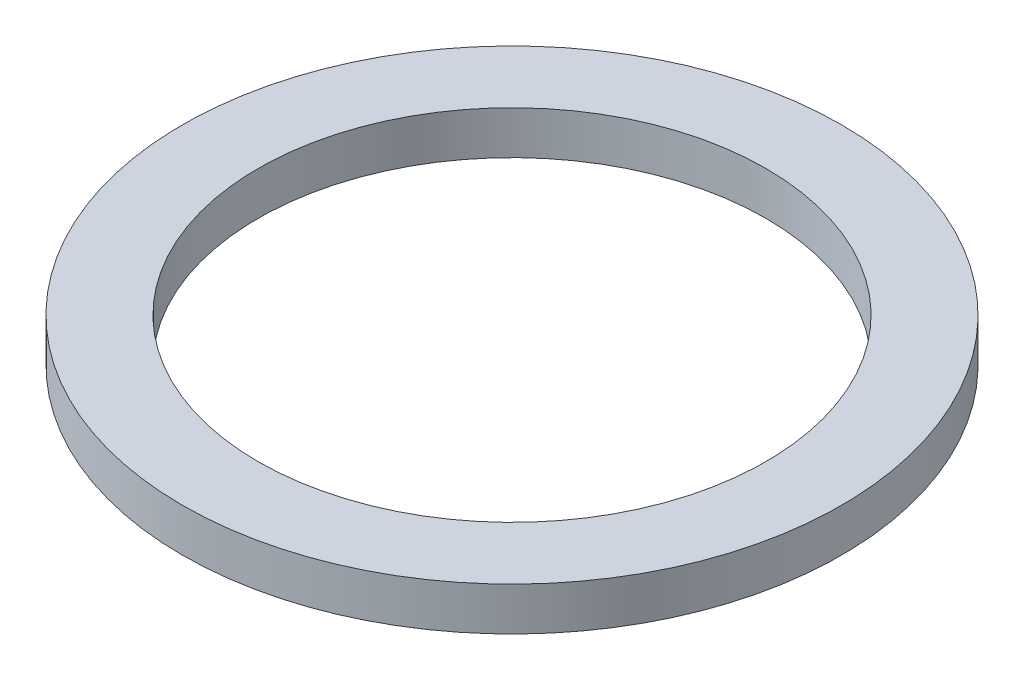
ISO-10303-21;
HEADER;
FILE_DESCRIPTION(('STEP AP214'),'2;1');
FILE_NAME('part.step','',(''),(''),'','','');
FILE_SCHEMA(('AUTOMOTIVE_DESIGN { 1 0 10303 214 1 1 1 1 }'));
ENDSEC;
DATA;
#1=APPLICATION_CONTEXT('core data for automotive mechanical design processes');
#2=APPLICATION_PROTOCOL_DEFINITION('international standard','automotive_design',2000,#1);
#3=PRODUCT_CONTEXT('',#1,'mechanical');
#4=PRODUCT('Part','Part','',(#3));
#5=PRODUCT_RELATED_PRODUCT_CATEGORY('part','',(#4));
#6=PRODUCT_DEFINITION_FORMATION('','',#4);
#7=PRODUCT_DEFINITION_CONTEXT('part definition',#1,'design');
#8=PRODUCT_DEFINITION('design','',#6,#7);
#9=PRODUCT_DEFINITION_SHAPE('','',#8);
#10=(LENGTH_UNIT() NAMED_UNIT(*) SI_UNIT(.MILLI.,.METRE.));
#11=(NAMED_UNIT(*) PLANE_ANGLE_UNIT() SI_UNIT($,.RADIAN.));
#12=(NAMED_UNIT(*) SI_UNIT($,.STERADIAN.) SOLID_ANGLE_UNIT());
#13=UNCERTAINTY_MEASURE_WITH_UNIT(LENGTH_MEASURE(1.E-05),#10,'distance_accuracy_value','');
#14=(GEOMETRIC_REPRESENTATION_CONTEXT(3) GLOBAL_UNCERTAINTY_ASSIGNED_CONTEXT((#13)) GLOBAL_UNIT_ASSIGNED_CONTEXT((#10,
#11,#12)) REPRESENTATION_CONTEXT('',''));
#15=CARTESIAN_POINT('',(0.,0.,0.));
#16=DIRECTION('',(0.,0.,1.));
#17=DIRECTION('',(1.,0.,0.));
#18=AXIS2_PLACEMENT_3D('',#15,#16,#17);
#19=CARTESIAN_POINT('',(0.,4.,0.));
#20=DIRECTION('',(0.,1.,0.));
#21=DIRECTION('',(0.,0.,1.));
#22=AXIS2_PLACEMENT_3D('',#19,#20,#21);
#23=PLANE('',#22);
#24=CARTESIAN_POINT('',(0.,4.,0.));
#25=DIRECTION('',(0.,1.,0.));
#26=DIRECTION('',(0.,0.,1.));
#27=AXIS2_PLACEMENT_3D('',#24,#25,#26);
#28=CIRCLE('',#27,30.5);
#29=CARTESIAN_POINT('',(0.,4.,30.5));
#30=VERTEX_POINT('',#29);
#31=EDGE_CURVE('E10',#30,#30,#28,.T.);
#32=ORIENTED_EDGE('',*,*,#31,.T.);
#33=EDGE_LOOP('',(#32));
#34=FACE_BOUND('',#33,.T.);
#35=CARTESIAN_POINT('',(0.,4.,0.));
#36=DIRECTION('',(0.,1.,0.));
#37=DIRECTION('',(0.,0.,1.));
#38=AXIS2_PLACEMENT_3D('',#35,#36,#37);
#39=CIRCLE('',#38,23.5);
#40=CARTESIAN_POINT('',(0.,4.,23.5));
#41=VERTEX_POINT('',#40);
#42=EDGE_CURVE('E41',#41,#41,#39,.T.);
#43=ORIENTED_EDGE('',*,*,#42,.F.);
#44=EDGE_LOOP('',(#43));
#45=FACE_BOUND('',#44,.T.);
#46=ADVANCED_FACE('F30',(#34,#45),#23,.T.);
#47=CARTESIAN_POINT('',(0.,0.,0.));
#48=DIRECTION('',(0.,1.,0.));
#49=DIRECTION('',(0.,0.,1.));
#50=AXIS2_PLACEMENT_3D('',#47,#48,#49);
#51=PLANE('',#50);
#52=CARTESIAN_POINT('',(0.,0.,0.));
#53=DIRECTION('',(0.,1.,0.));
#54=DIRECTION('',(0.,0.,1.));
#55=AXIS2_PLACEMENT_3D('',#52,#53,#54);
#56=CIRCLE('',#55,30.5);
#57=CARTESIAN_POINT('',(0.,0.,30.5));
#58=VERTEX_POINT('',#57);
#59=EDGE_CURVE('E34',#58,#58,#56,.T.);
#60=ORIENTED_EDGE('',*,*,#59,.F.);
#61=EDGE_LOOP('',(#60));
#62=FACE_BOUND('',#61,.T.);
#63=CARTESIAN_POINT('',(0.,0.,0.));
#64=DIRECTION('',(0.,1.,0.));
#65=DIRECTION('',(0.,0.,1.));
#66=AXIS2_PLACEMENT_3D('',#63,#64,#65);
#67=CIRCLE('',#66,23.5);
#68=CARTESIAN_POINT('',(0.,0.,23.5));
#69=VERTEX_POINT('',#68);
#70=EDGE_CURVE('E43',#69,#69,#67,.T.);
#71=ORIENTED_EDGE('',*,*,#70,.T.);
#72=EDGE_LOOP('',(#71));
#73=FACE_BOUND('',#72,.T.);
#74=ADVANCED_FACE('F53',(#62,#73),#51,.F.);
#75=CARTESIAN_POINT('',(0.,4.,0.));
#76=DIRECTION('',(0.,-1.,0.));
#77=DIRECTION('',(0.,0.,-1.));
#78=AXIS2_PLACEMENT_3D('',#75,#76,#77);
#79=CYLINDRICAL_SURFACE('',#78,30.5);
#80=ORIENTED_EDGE('',*,*,#31,.F.);
#81=EDGE_LOOP('',(#80));
#82=FACE_BOUND('',#81,.T.);
#83=ORIENTED_EDGE('',*,*,#59,.T.);
#84=EDGE_LOOP('',(#83));
#85=FACE_BOUND('',#84,.T.);
#86=ADVANCED_FACE('F32',(#82,#85),#79,.T.);
#87=CARTESIAN_POINT('',(0.,4.,0.));
#88=DIRECTION('',(0.,-1.,0.));
#89=DIRECTION('',(0.,0.,-1.));
#90=AXIS2_PLACEMENT_3D('',#87,#88,#89);
#91=CYLINDRICAL_SURFACE('',#90,23.5);
#92=ORIENTED_EDGE('',*,*,#42,.T.);
#93=EDGE_LOOP('',(#92));
#94=FACE_BOUND('',#93,.T.);
#95=ORIENTED_EDGE('',*,*,#70,.F.);
#96=EDGE_LOOP('',(#95));
#97=FACE_BOUND('',#96,.T.);
#98=ADVANCED_FACE('F49',(#94,#97),#91,.F.);
#99=CLOSED_SHELL('',(#46,#74,#86,#98));
#100=MANIFOLD_SOLID_BREP('B2',#99);
#101=ADVANCED_BREP_SHAPE_REPRESENTATION('',(#18,#100),#14);
#102=SHAPE_DEFINITION_REPRESENTATION(#9,#101);
ENDSEC;
END-ISO-10303-21;
